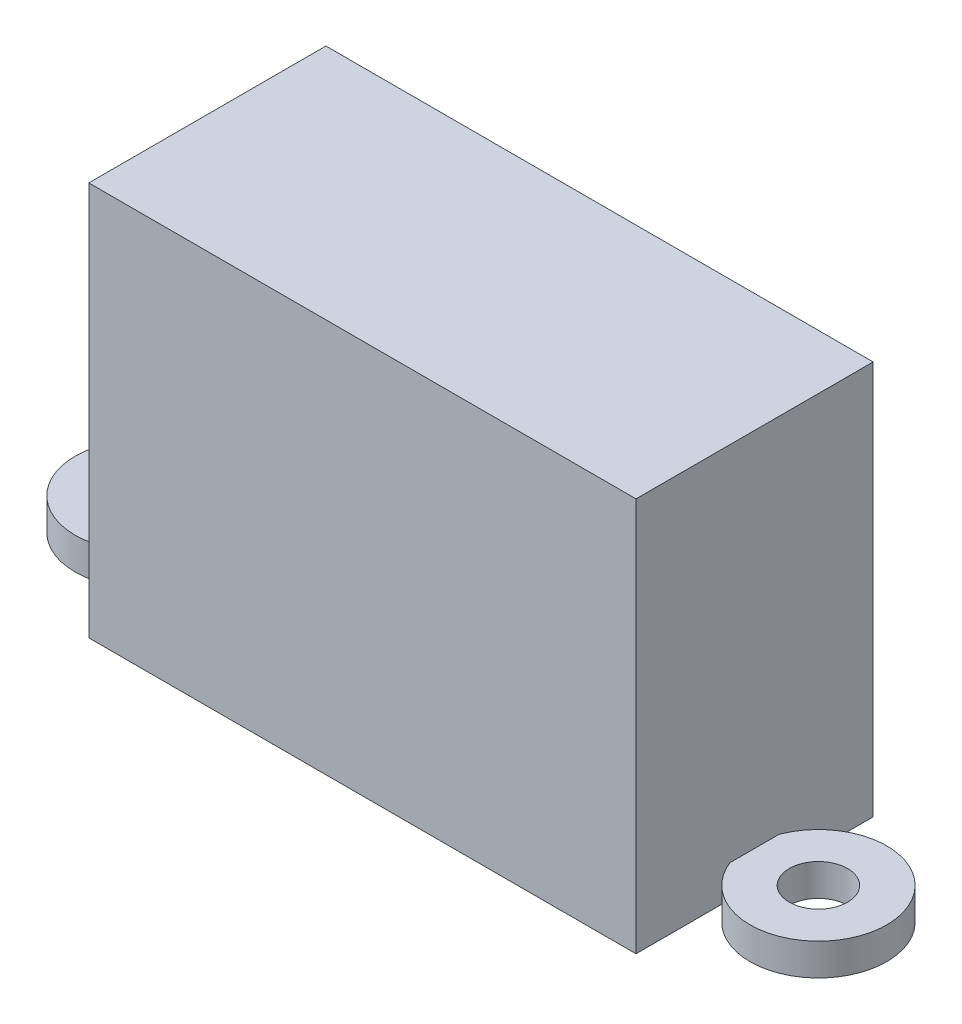
ISO-10303-21;
HEADER;
FILE_DESCRIPTION(('STEP AP214'),'2;1');
FILE_NAME('part.step','',(''),(''),'','','');
FILE_SCHEMA(('AUTOMOTIVE_DESIGN { 1 0 10303 214 1 1 1 1 }'));
ENDSEC;
DATA;
#1=APPLICATION_CONTEXT('core data for automotive mechanical design processes');
#2=APPLICATION_PROTOCOL_DEFINITION('international standard','automotive_design',2000,#1);
#3=PRODUCT_CONTEXT('',#1,'mechanical');
#4=PRODUCT('Part','Part','',(#3));
#5=PRODUCT_RELATED_PRODUCT_CATEGORY('part','',(#4));
#6=PRODUCT_DEFINITION_FORMATION('','',#4);
#7=PRODUCT_DEFINITION_CONTEXT('part definition',#1,'design');
#8=PRODUCT_DEFINITION('design','',#6,#7);
#9=PRODUCT_DEFINITION_SHAPE('','',#8);
#10=(LENGTH_UNIT() NAMED_UNIT(*) SI_UNIT(.MILLI.,.METRE.));
#11=(NAMED_UNIT(*) PLANE_ANGLE_UNIT() SI_UNIT($,.RADIAN.));
#12=(NAMED_UNIT(*) SI_UNIT($,.STERADIAN.) SOLID_ANGLE_UNIT());
#13=UNCERTAINTY_MEASURE_WITH_UNIT(LENGTH_MEASURE(1.E-05),#10,'distance_accuracy_value','');
#14=(GEOMETRIC_REPRESENTATION_CONTEXT(3) GLOBAL_UNCERTAINTY_ASSIGNED_CONTEXT((#13)) GLOBAL_UNIT_ASSIGNED_CONTEXT((#10,
#11,#12)) REPRESENTATION_CONTEXT('',''));
#15=CARTESIAN_POINT('',(0.,0.,0.));
#16=DIRECTION('',(0.,0.,1.));
#17=DIRECTION('',(1.,0.,0.));
#18=AXIS2_PLACEMENT_3D('',#15,#16,#17);
#19=CARTESIAN_POINT('',(15.,21.6,-6.5));
#20=DIRECTION('',(-1.,0.,0.));
#21=DIRECTION('',(0.,0.,1.));
#22=AXIS2_PLACEMENT_3D('',#19,#20,#21);
#23=PLANE('',#22);
#24=DIRECTION('',(0.,0.,-1.));
#25=VECTOR('',#24,1.);
#26=CARTESIAN_POINT('',(15.,0.,-6.5));
#27=LINE('',#26,#25);
#28=CARTESIAN_POINT('',(15.,0.,6.5));
#29=VERTEX_POINT('',#28);
#30=CARTESIAN_POINT('',(15.,0.,-6.5));
#31=VERTEX_POINT('',#30);
#32=EDGE_CURVE('E118',#29,#31,#27,.T.);
#33=ORIENTED_EDGE('',*,*,#32,.T.);
#34=DIRECTION('',(0.,-1.,0.));
#35=VECTOR('',#34,1.);
#36=CARTESIAN_POINT('',(15.,21.6,-6.5));
#37=LINE('',#36,#35);
#38=CARTESIAN_POINT('',(15.,21.6,-6.5));
#39=VERTEX_POINT('',#38);
#40=EDGE_CURVE('E12',#39,#31,#37,.T.);
#41=ORIENTED_EDGE('',*,*,#40,.F.);
#42=DIRECTION('',(0.,0.,-1.));
#43=VECTOR('',#42,1.);
#44=CARTESIAN_POINT('',(15.,21.6,-6.5));
#45=LINE('',#44,#43);
#46=CARTESIAN_POINT('',(15.,21.6,6.5));
#47=VERTEX_POINT('',#46);
#48=EDGE_CURVE('E102',#47,#39,#45,.T.);
#49=ORIENTED_EDGE('',*,*,#48,.F.);
#50=DIRECTION('',(0.,-1.,0.));
#51=VECTOR('',#50,1.);
#52=CARTESIAN_POINT('',(15.,21.6,6.5));
#53=LINE('',#52,#51);
#54=EDGE_CURVE('E114',#47,#29,#53,.T.);
#55=ORIENTED_EDGE('',*,*,#54,.T.);
#56=EDGE_LOOP('',(#33,#41,#49,#55));
#57=FACE_BOUND('',#56,.T.);
#58=ADVANCED_FACE('F50',(#57),#23,.F.);
#59=CARTESIAN_POINT('',(-15.,21.6,-6.5));
#60=DIRECTION('',(0.,0.,1.));
#61=DIRECTION('',(1.,0.,0.));
#62=AXIS2_PLACEMENT_3D('',#59,#60,#61);
#63=PLANE('',#62);
#64=DIRECTION('',(-1.,0.,0.));
#65=VECTOR('',#64,1.);
#66=CARTESIAN_POINT('',(-15.,0.,-6.5));
#67=LINE('',#66,#65);
#68=CARTESIAN_POINT('',(-15.,0.,-6.5));
#69=VERTEX_POINT('',#68);
#70=EDGE_CURVE('E107',#31,#69,#67,.T.);
#71=ORIENTED_EDGE('',*,*,#70,.T.);
#72=DIRECTION('',(0.,-1.,0.));
#73=VECTOR('',#72,1.);
#74=CARTESIAN_POINT('',(-15.,21.6,-6.5));
#75=LINE('',#74,#73);
#76=CARTESIAN_POINT('',(-15.,21.6,-6.5));
#77=VERTEX_POINT('',#76);
#78=EDGE_CURVE('E59',#77,#69,#75,.T.);
#79=ORIENTED_EDGE('',*,*,#78,.F.);
#80=DIRECTION('',(-1.,0.,0.));
#81=VECTOR('',#80,1.);
#82=CARTESIAN_POINT('',(-15.,21.6,-6.5));
#83=LINE('',#82,#81);
#84=EDGE_CURVE('E97',#39,#77,#83,.T.);
#85=ORIENTED_EDGE('',*,*,#84,.F.);
#86=ORIENTED_EDGE('',*,*,#40,.T.);
#87=EDGE_LOOP('',(#71,#79,#85,#86));
#88=FACE_BOUND('',#87,.T.);
#89=ADVANCED_FACE('F106',(#88),#63,.F.);
#90=CARTESIAN_POINT('',(-15.,21.6,-6.5));
#91=DIRECTION('',(1.,0.,0.));
#92=DIRECTION('',(0.,0.,-1.));
#93=AXIS2_PLACEMENT_3D('',#90,#91,#92);
#94=PLANE('',#93);
#95=DIRECTION('',(0.,0.,1.));
#96=VECTOR('',#95,1.);
#97=CARTESIAN_POINT('',(-15.,0.,-6.5));
#98=LINE('',#97,#96);
#99=CARTESIAN_POINT('',(-15.,0.,6.5));
#100=VERTEX_POINT('',#99);
#101=EDGE_CURVE('E84',#69,#100,#98,.T.);
#102=ORIENTED_EDGE('',*,*,#101,.T.);
#103=DIRECTION('',(0.,-1.,0.));
#104=VECTOR('',#103,1.);
#105=CARTESIAN_POINT('',(-15.,21.6,6.5));
#106=LINE('',#105,#104);
#107=CARTESIAN_POINT('',(-15.,21.6,6.5));
#108=VERTEX_POINT('',#107);
#109=EDGE_CURVE('E109',#108,#100,#106,.T.);
#110=ORIENTED_EDGE('',*,*,#109,.F.);
#111=DIRECTION('',(0.,0.,1.));
#112=VECTOR('',#111,1.);
#113=CARTESIAN_POINT('',(-15.,21.6,-6.5));
#114=LINE('',#113,#112);
#115=EDGE_CURVE('E100',#77,#108,#114,.T.);
#116=ORIENTED_EDGE('',*,*,#115,.F.);
#117=ORIENTED_EDGE('',*,*,#78,.T.);
#118=EDGE_LOOP('',(#102,#110,#116,#117));
#119=FACE_BOUND('',#118,.T.);
#120=ADVANCED_FACE('F110',(#119),#94,.F.);
#121=CARTESIAN_POINT('',(-15.,21.6,6.5));
#122=DIRECTION('',(0.,0.,-1.));
#123=DIRECTION('',(-1.,0.,0.));
#124=AXIS2_PLACEMENT_3D('',#121,#122,#123);
#125=PLANE('',#124);
#126=DIRECTION('',(1.,0.,0.));
#127=VECTOR('',#126,1.);
#128=CARTESIAN_POINT('',(-15.,0.,6.5));
#129=LINE('',#128,#127);
#130=EDGE_CURVE('E90',#100,#29,#129,.T.);
#131=ORIENTED_EDGE('',*,*,#130,.T.);
#132=ORIENTED_EDGE('',*,*,#54,.F.);
#133=DIRECTION('',(1.,0.,0.));
#134=VECTOR('',#133,1.);
#135=CARTESIAN_POINT('',(-15.,21.6,6.5));
#136=LINE('',#135,#134);
#137=EDGE_CURVE('E67',#108,#47,#136,.T.);
#138=ORIENTED_EDGE('',*,*,#137,.F.);
#139=ORIENTED_EDGE('',*,*,#109,.T.);
#140=EDGE_LOOP('',(#131,#132,#138,#139));
#141=FACE_BOUND('',#140,.T.);
#142=ADVANCED_FACE('F131',(#141),#125,.F.);
#143=CARTESIAN_POINT('',(0.,21.6,0.));
#144=DIRECTION('',(0.,1.,0.));
#145=DIRECTION('',(0.,0.,1.));
#146=AXIS2_PLACEMENT_3D('',#143,#144,#145);
#147=PLANE('',#146);
#148=ORIENTED_EDGE('',*,*,#48,.T.);
#149=ORIENTED_EDGE('',*,*,#84,.T.);
#150=ORIENTED_EDGE('',*,*,#115,.T.);
#151=ORIENTED_EDGE('',*,*,#137,.T.);
#152=EDGE_LOOP('',(#148,#149,#150,#151));
#153=FACE_BOUND('',#152,.T.);
#154=ADVANCED_FACE('F98',(#153),#147,.T.);
#155=CARTESIAN_POINT('',(0.,0.,0.));
#156=DIRECTION('',(0.,1.,0.));
#157=DIRECTION('',(0.,0.,1.));
#158=AXIS2_PLACEMENT_3D('',#155,#156,#157);
#159=PLANE('',#158);
#160=ORIENTED_EDGE('',*,*,#32,.F.);
#161=ORIENTED_EDGE('',*,*,#130,.F.);
#162=ORIENTED_EDGE('',*,*,#101,.F.);
#163=ORIENTED_EDGE('',*,*,#70,.F.);
#164=EDGE_LOOP('',(#160,#161,#162,#163));
#165=FACE_BOUND('',#164,.T.);
#166=ADVANCED_FACE('F134',(#165),#159,.F.);
#167=CLOSED_SHELL('',(#58,#89,#120,#142,#154,#166));
#168=MANIFOLD_SOLID_BREP('B2',#167);
#169=CARTESIAN_POINT('',(18.5,1.75,0.));
#170=DIRECTION('',(0.,-1.,0.));
#171=DIRECTION('',(0.,0.,-1.));
#172=AXIS2_PLACEMENT_3D('',#169,#170,#171);
#173=CYLINDRICAL_SURFACE('',#172,1.6);
#174=CARTESIAN_POINT('',(18.5,1.75,0.));
#175=DIRECTION('',(0.,1.,0.));
#176=DIRECTION('',(0.,0.,1.));
#177=AXIS2_PLACEMENT_3D('',#174,#175,#176);
#178=CIRCLE('',#177,1.6);
#179=CARTESIAN_POINT('',(18.5,1.75,1.6));
#180=VERTEX_POINT('',#179);
#181=EDGE_CURVE('E200',#180,#180,#178,.T.);
#182=ORIENTED_EDGE('',*,*,#181,.T.);
#183=EDGE_LOOP('',(#182));
#184=FACE_BOUND('',#183,.T.);
#185=CARTESIAN_POINT('',(18.5,0.,0.));
#186=DIRECTION('',(0.,1.,0.));
#187=DIRECTION('',(0.,0.,1.));
#188=AXIS2_PLACEMENT_3D('',#185,#186,#187);
#189=CIRCLE('',#188,1.6);
#190=CARTESIAN_POINT('',(18.5,0.,1.6));
#191=VERTEX_POINT('',#190);
#192=EDGE_CURVE('E206',#191,#191,#189,.T.);
#193=ORIENTED_EDGE('',*,*,#192,.F.);
#194=EDGE_LOOP('',(#193));
#195=FACE_BOUND('',#194,.T.);
#196=ADVANCED_FACE('F193',(#184,#195),#173,.F.);
#197=CARTESIAN_POINT('',(18.5,1.75,0.));
#198=DIRECTION('',(0.,-1.,0.));
#199=DIRECTION('',(0.,0.,-1.));
#200=AXIS2_PLACEMENT_3D('',#197,#198,#199);
#201=CYLINDRICAL_SURFACE('',#200,3.75);
#202=CARTESIAN_POINT('',(18.5,1.75,0.));
#203=DIRECTION('',(0.,1.,0.));
#204=DIRECTION('',(0.,0.,1.));
#205=AXIS2_PLACEMENT_3D('',#202,#203,#204);
#206=CIRCLE('',#205,3.75);
#207=CARTESIAN_POINT('',(18.5,1.75,3.75));
#208=VERTEX_POINT('',#207);
#209=EDGE_CURVE('E49',#208,#208,#206,.T.);
#210=ORIENTED_EDGE('',*,*,#209,.F.);
#211=EDGE_LOOP('',(#210));
#212=FACE_BOUND('',#211,.T.);
#213=CARTESIAN_POINT('',(18.5,0.,0.));
#214=DIRECTION('',(0.,1.,0.));
#215=DIRECTION('',(0.,0.,1.));
#216=AXIS2_PLACEMENT_3D('',#213,#214,#215);
#217=CIRCLE('',#216,3.75);
#218=CARTESIAN_POINT('',(18.5,0.,3.75));
#219=VERTEX_POINT('',#218);
#220=EDGE_CURVE('E196',#219,#219,#217,.T.);
#221=ORIENTED_EDGE('',*,*,#220,.T.);
#222=EDGE_LOOP('',(#221));
#223=FACE_BOUND('',#222,.T.);
#224=ADVANCED_FACE('F213',(#212,#223),#201,.T.);
#225=CARTESIAN_POINT('',(0.,1.75,0.));
#226=DIRECTION('',(0.,1.,0.));
#227=DIRECTION('',(0.,0.,1.));
#228=AXIS2_PLACEMENT_3D('',#225,#226,#227);
#229=PLANE('',#228);
#230=ORIENTED_EDGE('',*,*,#181,.F.);
#231=EDGE_LOOP('',(#230));
#232=FACE_BOUND('',#231,.T.);
#233=ORIENTED_EDGE('',*,*,#209,.T.);
#234=EDGE_LOOP('',(#233));
#235=FACE_BOUND('',#234,.T.);
#236=ADVANCED_FACE('F217',(#232,#235),#229,.T.);
#237=CARTESIAN_POINT('',(0.,0.,0.));
#238=DIRECTION('',(0.,1.,0.));
#239=DIRECTION('',(0.,0.,1.));
#240=AXIS2_PLACEMENT_3D('',#237,#238,#239);
#241=PLANE('',#240);
#242=ORIENTED_EDGE('',*,*,#192,.T.);
#243=EDGE_LOOP('',(#242));
#244=FACE_BOUND('',#243,.T.);
#245=ORIENTED_EDGE('',*,*,#220,.F.);
#246=EDGE_LOOP('',(#245));
#247=FACE_BOUND('',#246,.T.);
#248=ADVANCED_FACE('F215',(#244,#247),#241,.F.);
#249=CLOSED_SHELL('',(#196,#224,#236,#248));
#250=MANIFOLD_SOLID_BREP('B6',#249);
#251=CARTESIAN_POINT('',(-18.5,1.75,0.));
#252=DIRECTION('',(0.,-1.,0.));
#253=DIRECTION('',(0.,0.,-1.));
#254=AXIS2_PLACEMENT_3D('',#251,#252,#253);
#255=CYLINDRICAL_SURFACE('',#254,3.75);
#256=CARTESIAN_POINT('',(-18.5,1.75,0.));
#257=DIRECTION('',(0.,1.,0.));
#258=DIRECTION('',(0.,0.,1.));
#259=AXIS2_PLACEMENT_3D('',#256,#257,#258);
#260=CIRCLE('',#259,3.75);
#261=CARTESIAN_POINT('',(-18.5,1.75,3.75));
#262=VERTEX_POINT('',#261);
#263=EDGE_CURVE('E262',#262,#262,#260,.T.);
#264=ORIENTED_EDGE('',*,*,#263,.F.);
#265=EDGE_LOOP('',(#264));
#266=FACE_BOUND('',#265,.T.);
#267=CARTESIAN_POINT('',(-18.5,0.,0.));
#268=DIRECTION('',(0.,1.,0.));
#269=DIRECTION('',(0.,0.,1.));
#270=AXIS2_PLACEMENT_3D('',#267,#268,#269);
#271=CIRCLE('',#270,3.75);
#272=CARTESIAN_POINT('',(-18.5,0.,3.75));
#273=VERTEX_POINT('',#272);
#274=EDGE_CURVE('E268',#273,#273,#271,.T.);
#275=ORIENTED_EDGE('',*,*,#274,.T.);
#276=EDGE_LOOP('',(#275));
#277=FACE_BOUND('',#276,.T.);
#278=ADVANCED_FACE('F255',(#266,#277),#255,.T.);
#279=CARTESIAN_POINT('',(-18.5,1.75,0.));
#280=DIRECTION('',(0.,-1.,0.));
#281=DIRECTION('',(0.,0.,-1.));
#282=AXIS2_PLACEMENT_3D('',#279,#280,#281);
#283=CYLINDRICAL_SURFACE('',#282,1.6);
#284=CARTESIAN_POINT('',(-18.5,1.75,0.));
#285=DIRECTION('',(0.,1.,0.));
#286=DIRECTION('',(0.,0.,1.));
#287=AXIS2_PLACEMENT_3D('',#284,#285,#286);
#288=CIRCLE('',#287,1.6);
#289=CARTESIAN_POINT('',(-18.5,1.75,1.6));
#290=VERTEX_POINT('',#289);
#291=EDGE_CURVE('E192',#290,#290,#288,.T.);
#292=ORIENTED_EDGE('',*,*,#291,.T.);
#293=EDGE_LOOP('',(#292));
#294=FACE_BOUND('',#293,.T.);
#295=CARTESIAN_POINT('',(-18.5,0.,0.));
#296=DIRECTION('',(0.,1.,0.));
#297=DIRECTION('',(0.,0.,1.));
#298=AXIS2_PLACEMENT_3D('',#295,#296,#297);
#299=CIRCLE('',#298,1.6);
#300=CARTESIAN_POINT('',(-18.5,0.,1.6));
#301=VERTEX_POINT('',#300);
#302=EDGE_CURVE('E258',#301,#301,#299,.T.);
#303=ORIENTED_EDGE('',*,*,#302,.F.);
#304=EDGE_LOOP('',(#303));
#305=FACE_BOUND('',#304,.T.);
#306=ADVANCED_FACE('F277',(#294,#305),#283,.F.);
#307=CARTESIAN_POINT('',(0.,1.75,0.));
#308=DIRECTION('',(0.,1.,0.));
#309=DIRECTION('',(0.,0.,1.));
#310=AXIS2_PLACEMENT_3D('',#307,#308,#309);
#311=PLANE('',#310);
#312=ORIENTED_EDGE('',*,*,#263,.T.);
#313=EDGE_LOOP('',(#312));
#314=FACE_BOUND('',#313,.T.);
#315=ORIENTED_EDGE('',*,*,#291,.F.);
#316=EDGE_LOOP('',(#315));
#317=FACE_BOUND('',#316,.T.);
#318=ADVANCED_FACE('F279',(#314,#317),#311,.T.);
#319=CARTESIAN_POINT('',(0.,0.,0.));
#320=DIRECTION('',(0.,1.,0.));
#321=DIRECTION('',(0.,0.,1.));
#322=AXIS2_PLACEMENT_3D('',#319,#320,#321);
#323=PLANE('',#322);
#324=ORIENTED_EDGE('',*,*,#274,.F.);
#325=EDGE_LOOP('',(#324));
#326=FACE_BOUND('',#325,.T.);
#327=ORIENTED_EDGE('',*,*,#302,.T.);
#328=EDGE_LOOP('',(#327));
#329=FACE_BOUND('',#328,.T.);
#330=ADVANCED_FACE('F275',(#326,#329),#323,.F.);
#331=CLOSED_SHELL('',(#278,#306,#318,#330));
#332=MANIFOLD_SOLID_BREP('B44',#331);
#333=ADVANCED_BREP_SHAPE_REPRESENTATION('',(#18,#168,#250,#332),#14);
#334=SHAPE_DEFINITION_REPRESENTATION(#9,#333);
ENDSEC;
END-ISO-10303-21;
